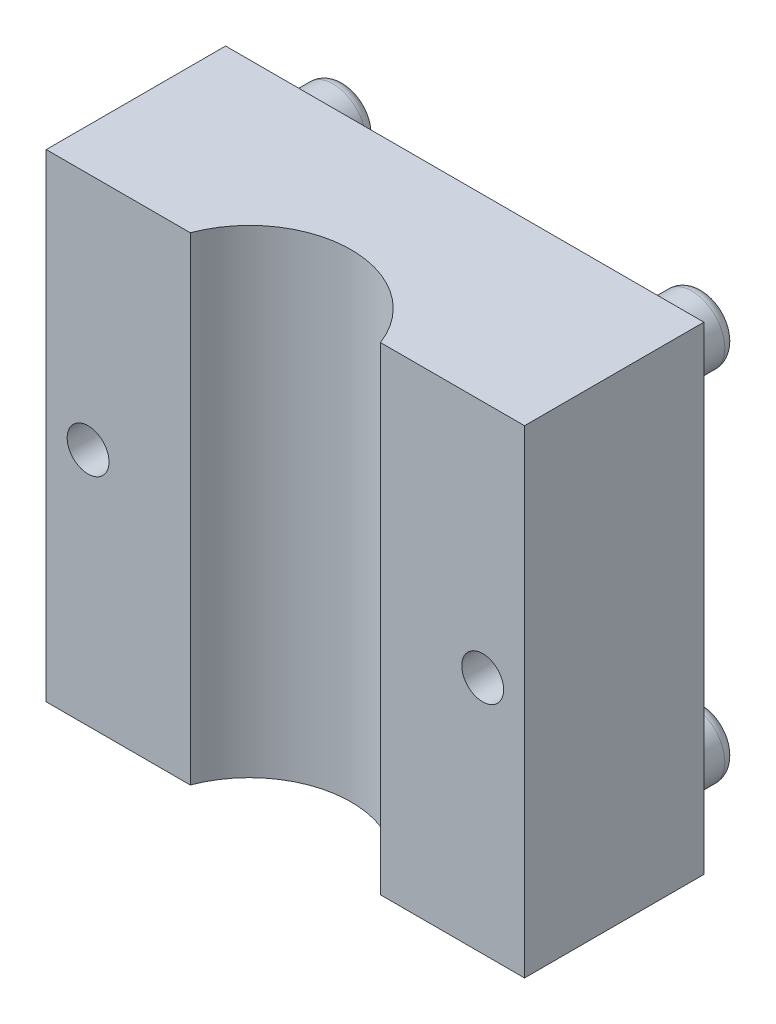
ISO-10303-21;
HEADER;
FILE_DESCRIPTION(('STEP AP214'),'2;1');
FILE_NAME('part.step','',(''),(''),'','','');
FILE_SCHEMA(('AUTOMOTIVE_DESIGN { 1 0 10303 214 1 1 1 1 }'));
ENDSEC;
DATA;
#1=APPLICATION_CONTEXT('core data for automotive mechanical design processes');
#2=APPLICATION_PROTOCOL_DEFINITION('international standard','automotive_design',2000,#1);
#3=PRODUCT_CONTEXT('',#1,'mechanical');
#4=PRODUCT('Part','Part','',(#3));
#5=PRODUCT_RELATED_PRODUCT_CATEGORY('part','',(#4));
#6=PRODUCT_DEFINITION_FORMATION('','',#4);
#7=PRODUCT_DEFINITION_CONTEXT('part definition',#1,'design');
#8=PRODUCT_DEFINITION('design','',#6,#7);
#9=PRODUCT_DEFINITION_SHAPE('','',#8);
#10=(LENGTH_UNIT() NAMED_UNIT(*) SI_UNIT(.MILLI.,.METRE.));
#11=(NAMED_UNIT(*) PLANE_ANGLE_UNIT() SI_UNIT($,.RADIAN.));
#12=(NAMED_UNIT(*) SI_UNIT($,.STERADIAN.) SOLID_ANGLE_UNIT());
#13=UNCERTAINTY_MEASURE_WITH_UNIT(LENGTH_MEASURE(1.E-05),#10,'distance_accuracy_value','');
#14=(GEOMETRIC_REPRESENTATION_CONTEXT(3) GLOBAL_UNCERTAINTY_ASSIGNED_CONTEXT((#13)) GLOBAL_UNIT_ASSIGNED_CONTEXT((#10,
#11,#12)) REPRESENTATION_CONTEXT('',''));
#15=CARTESIAN_POINT('',(0.,0.,0.));
#16=DIRECTION('',(0.,0.,1.));
#17=DIRECTION('',(1.,0.,0.));
#18=AXIS2_PLACEMENT_3D('',#15,#16,#17);
#19=CARTESIAN_POINT('',(0.,0.,15.));
#20=DIRECTION('',(0.,0.,1.));
#21=DIRECTION('',(1.,0.,0.));
#22=AXIS2_PLACEMENT_3D('',#19,#20,#21);
#23=PLANE('',#22);
#24=CARTESIAN_POINT('',(16.5,0.,15.));
#25=DIRECTION('',(0.,0.,-1.));
#26=DIRECTION('',(-1.,0.,0.));
#27=AXIS2_PLACEMENT_3D('',#24,#25,#26);
#28=CIRCLE('',#27,1.75);
#29=CARTESIAN_POINT('',(14.75,0.,15.));
#30=VERTEX_POINT('',#29);
#31=EDGE_CURVE('E184',#30,#30,#28,.T.);
#32=ORIENTED_EDGE('',*,*,#31,.T.);
#33=EDGE_LOOP('',(#32));
#34=FACE_BOUND('',#33,.T.);
#35=DIRECTION('',(0.,1.,0.));
#36=VECTOR('',#35,1.);
#37=CARTESIAN_POINT('',(7.95298686029343,-20.,15.));
#38=LINE('',#37,#36);
#39=CARTESIAN_POINT('',(7.95298686029343,-20.,15.));
#40=VERTEX_POINT('',#39);
#41=CARTESIAN_POINT('',(7.95298686029343,20.,15.));
#42=VERTEX_POINT('',#41);
#43=EDGE_CURVE('E11',#40,#42,#38,.T.);
#44=ORIENTED_EDGE('',*,*,#43,.F.);
#45=DIRECTION('',(1.,0.,0.));
#46=VECTOR('',#45,1.);
#47=CARTESIAN_POINT('',(-20.,-20.,15.));
#48=LINE('',#47,#46);
#49=CARTESIAN_POINT('',(20.,-20.,15.));
#50=VERTEX_POINT('',#49);
#51=EDGE_CURVE('E58',#40,#50,#48,.T.);
#52=ORIENTED_EDGE('',*,*,#51,.T.);
#53=DIRECTION('',(0.,1.,0.));
#54=VECTOR('',#53,1.);
#55=CARTESIAN_POINT('',(20.,20.,15.));
#56=LINE('',#55,#54);
#57=CARTESIAN_POINT('',(20.,20.,15.));
#58=VERTEX_POINT('',#57);
#59=EDGE_CURVE('E105',#50,#58,#56,.T.);
#60=ORIENTED_EDGE('',*,*,#59,.T.);
#61=DIRECTION('',(-1.,0.,0.));
#62=VECTOR('',#61,1.);
#63=CARTESIAN_POINT('',(-20.,20.,15.));
#64=LINE('',#63,#62);
#65=EDGE_CURVE('E87',#58,#42,#64,.T.);
#66=ORIENTED_EDGE('',*,*,#65,.T.);
#67=EDGE_LOOP('',(#44,#52,#60,#66));
#68=FACE_BOUND('',#67,.T.);
#69=ADVANCED_FACE('F33',(#34,#68),#23,.T.);
#70=CARTESIAN_POINT('',(0.,0.,0.));
#71=DIRECTION('',(0.,0.,1.));
#72=DIRECTION('',(1.,0.,0.));
#73=AXIS2_PLACEMENT_3D('',#70,#71,#72);
#74=PLANE('',#73);
#75=CARTESIAN_POINT('',(-16.5,0.,0.));
#76=DIRECTION('',(0.,0.,-1.));
#77=DIRECTION('',(-1.,0.,0.));
#78=AXIS2_PLACEMENT_3D('',#75,#76,#77);
#79=CIRCLE('',#78,3.);
#80=CARTESIAN_POINT('',(-19.5,0.,0.));
#81=VERTEX_POINT('',#80);
#82=EDGE_CURVE('E172',#81,#81,#79,.T.);
#83=ORIENTED_EDGE('',*,*,#82,.F.);
#84=EDGE_LOOP('',(#83));
#85=FACE_BOUND('',#84,.T.);
#86=CARTESIAN_POINT('',(16.5,0.,0.));
#87=DIRECTION('',(0.,0.,-1.));
#88=DIRECTION('',(-1.,0.,0.));
#89=AXIS2_PLACEMENT_3D('',#86,#87,#88);
#90=CIRCLE('',#89,3.);
#91=CARTESIAN_POINT('',(13.5,0.,0.));
#92=VERTEX_POINT('',#91);
#93=EDGE_CURVE('E188',#92,#92,#90,.T.);
#94=ORIENTED_EDGE('',*,*,#93,.F.);
#95=EDGE_LOOP('',(#94));
#96=FACE_BOUND('',#95,.T.);
#97=CARTESIAN_POINT('',(0.,0.,0.));
#98=DIRECTION('',(0.,0.,-1.));
#99=DIRECTION('',(-1.,0.,0.));
#100=AXIS2_PLACEMENT_3D('',#97,#98,#99);
#101=CIRCLE('',#100,12.5);
#102=CARTESIAN_POINT('',(-12.5,0.,0.));
#103=VERTEX_POINT('',#102);
#104=EDGE_CURVE('E194',#103,#103,#101,.T.);
#105=ORIENTED_EDGE('',*,*,#104,.F.);
#106=EDGE_LOOP('',(#105));
#107=FACE_BOUND('',#106,.T.);
#108=CARTESIAN_POINT('',(15.,-15.,0.));
#109=DIRECTION('',(0.,0.,1.));
#110=DIRECTION('',(1.,0.,0.));
#111=AXIS2_PLACEMENT_3D('',#108,#109,#110);
#112=CIRCLE('',#111,2.75);
#113=CARTESIAN_POINT('',(17.75,-15.,0.));
#114=VERTEX_POINT('',#113);
#115=EDGE_CURVE('E140',#114,#114,#112,.F.);
#116=ORIENTED_EDGE('',*,*,#115,.F.);
#117=EDGE_LOOP('',(#116));
#118=FACE_BOUND('',#117,.T.);
#119=CARTESIAN_POINT('',(15.,15.,0.));
#120=DIRECTION('',(0.,0.,1.));
#121=DIRECTION('',(1.,0.,0.));
#122=AXIS2_PLACEMENT_3D('',#119,#120,#121);
#123=CIRCLE('',#122,2.75);
#124=CARTESIAN_POINT('',(17.75,15.,0.));
#125=VERTEX_POINT('',#124);
#126=EDGE_CURVE('E134',#125,#125,#123,.F.);
#127=ORIENTED_EDGE('',*,*,#126,.F.);
#128=EDGE_LOOP('',(#127));
#129=FACE_BOUND('',#128,.T.);
#130=DIRECTION('',(0.,1.,0.));
#131=VECTOR('',#130,1.);
#132=CARTESIAN_POINT('',(20.,20.,0.));
#133=LINE('',#132,#131);
#134=CARTESIAN_POINT('',(20.,-20.,0.));
#135=VERTEX_POINT('',#134);
#136=CARTESIAN_POINT('',(20.,20.,0.));
#137=VERTEX_POINT('',#136);
#138=EDGE_CURVE('E117',#135,#137,#133,.T.);
#139=ORIENTED_EDGE('',*,*,#138,.F.);
#140=DIRECTION('',(1.,0.,0.));
#141=VECTOR('',#140,1.);
#142=CARTESIAN_POINT('',(-20.,-20.,0.));
#143=LINE('',#142,#141);
#144=CARTESIAN_POINT('',(-20.,-20.,0.));
#145=VERTEX_POINT('',#144);
#146=EDGE_CURVE('E80',#145,#135,#143,.T.);
#147=ORIENTED_EDGE('',*,*,#146,.F.);
#148=DIRECTION('',(0.,-1.,0.));
#149=VECTOR('',#148,1.);
#150=CARTESIAN_POINT('',(-20.,20.,0.));
#151=LINE('',#150,#149);
#152=CARTESIAN_POINT('',(-20.,20.,0.));
#153=VERTEX_POINT('',#152);
#154=EDGE_CURVE('E123',#153,#145,#151,.T.);
#155=ORIENTED_EDGE('',*,*,#154,.F.);
#156=DIRECTION('',(-1.,0.,0.));
#157=VECTOR('',#156,1.);
#158=CARTESIAN_POINT('',(-20.,20.,0.));
#159=LINE('',#158,#157);
#160=EDGE_CURVE('E120',#137,#153,#159,.T.);
#161=ORIENTED_EDGE('',*,*,#160,.F.);
#162=EDGE_LOOP('',(#139,#147,#155,#161));
#163=FACE_BOUND('',#162,.T.);
#164=CARTESIAN_POINT('',(-15.,15.,0.));
#165=DIRECTION('',(0.,0.,1.));
#166=DIRECTION('',(1.,0.,0.));
#167=AXIS2_PLACEMENT_3D('',#164,#165,#166);
#168=CIRCLE('',#167,2.75);
#169=CARTESIAN_POINT('',(-12.25,15.,0.));
#170=VERTEX_POINT('',#169);
#171=EDGE_CURVE('E137',#170,#170,#168,.F.);
#172=ORIENTED_EDGE('',*,*,#171,.F.);
#173=EDGE_LOOP('',(#172));
#174=FACE_BOUND('',#173,.T.);
#175=CARTESIAN_POINT('',(-15.,-15.,0.));
#176=DIRECTION('',(0.,0.,1.));
#177=DIRECTION('',(1.,0.,0.));
#178=AXIS2_PLACEMENT_3D('',#175,#176,#177);
#179=CIRCLE('',#178,2.74999999999999);
#180=CARTESIAN_POINT('',(-12.25,-15.,0.));
#181=VERTEX_POINT('',#180);
#182=EDGE_CURVE('E143',#181,#181,#179,.F.);
#183=ORIENTED_EDGE('',*,*,#182,.F.);
#184=EDGE_LOOP('',(#183));
#185=FACE_BOUND('',#184,.T.);
#186=ADVANCED_FACE('F202',(#85,#96,#107,#118,#129,#163,#174,#185),#74,.F.);
#187=CARTESIAN_POINT('',(20.,20.,15.));
#188=DIRECTION('',(-1.,0.,0.));
#189=DIRECTION('',(0.,-1.,0.));
#190=AXIS2_PLACEMENT_3D('',#187,#188,#189);
#191=PLANE('',#190);
#192=ORIENTED_EDGE('',*,*,#138,.T.);
#193=DIRECTION('',(0.,0.,-1.));
#194=VECTOR('',#193,1.);
#195=CARTESIAN_POINT('',(20.,20.,15.));
#196=LINE('',#195,#194);
#197=EDGE_CURVE('E132',#58,#137,#196,.T.);
#198=ORIENTED_EDGE('',*,*,#197,.F.);
#199=ORIENTED_EDGE('',*,*,#59,.F.);
#200=DIRECTION('',(0.,0.,-1.));
#201=VECTOR('',#200,1.);
#202=CARTESIAN_POINT('',(20.,-20.,15.));
#203=LINE('',#202,#201);
#204=EDGE_CURVE('E116',#50,#135,#203,.T.);
#205=ORIENTED_EDGE('',*,*,#204,.T.);
#206=EDGE_LOOP('',(#192,#198,#199,#205));
#207=FACE_BOUND('',#206,.T.);
#208=ADVANCED_FACE('F205',(#207),#191,.F.);
#209=CARTESIAN_POINT('',(-20.,20.,15.));
#210=DIRECTION('',(0.,-1.,0.));
#211=DIRECTION('',(0.,0.,-1.));
#212=AXIS2_PLACEMENT_3D('',#209,#210,#211);
#213=PLANE('',#212);
#214=CARTESIAN_POINT('',(-7.95298686029344,20.,15.));
#215=VERTEX_POINT('',#214);
#216=CARTESIAN_POINT('',(-20.,20.,15.));
#217=VERTEX_POINT('',#216);
#218=EDGE_CURVE('E101',#215,#217,#64,.T.);
#219=ORIENTED_EDGE('',*,*,#218,.F.);
#220=CARTESIAN_POINT('',(0.,20.,18.));
#221=DIRECTION('',(0.,1.,0.));
#222=DIRECTION('',(0.,0.,1.));
#223=AXIS2_PLACEMENT_3D('',#220,#221,#222);
#224=CIRCLE('',#223,8.5);
#225=EDGE_CURVE('E49',#42,#215,#224,.T.);
#226=ORIENTED_EDGE('',*,*,#225,.F.);
#227=ORIENTED_EDGE('',*,*,#65,.F.);
#228=ORIENTED_EDGE('',*,*,#197,.T.);
#229=ORIENTED_EDGE('',*,*,#160,.T.);
#230=DIRECTION('',(0.,0.,-1.));
#231=VECTOR('',#230,1.);
#232=CARTESIAN_POINT('',(-20.,20.,15.));
#233=LINE('',#232,#231);
#234=EDGE_CURVE('E129',#217,#153,#233,.T.);
#235=ORIENTED_EDGE('',*,*,#234,.F.);
#236=EDGE_LOOP('',(#219,#226,#227,#228,#229,#235));
#237=FACE_BOUND('',#236,.T.);
#238=ADVANCED_FACE('F99',(#237),#213,.F.);
#239=CARTESIAN_POINT('',(-20.,20.,15.));
#240=DIRECTION('',(1.,0.,0.));
#241=DIRECTION('',(0.,1.,0.));
#242=AXIS2_PLACEMENT_3D('',#239,#240,#241);
#243=PLANE('',#242);
#244=ORIENTED_EDGE('',*,*,#154,.T.);
#245=DIRECTION('',(0.,0.,-1.));
#246=VECTOR('',#245,1.);
#247=CARTESIAN_POINT('',(-20.,-20.,15.));
#248=LINE('',#247,#246);
#249=CARTESIAN_POINT('',(-20.,-20.,15.));
#250=VERTEX_POINT('',#249);
#251=EDGE_CURVE('E127',#250,#145,#248,.T.);
#252=ORIENTED_EDGE('',*,*,#251,.F.);
#253=DIRECTION('',(0.,-1.,0.));
#254=VECTOR('',#253,1.);
#255=CARTESIAN_POINT('',(-20.,20.,15.));
#256=LINE('',#255,#254);
#257=EDGE_CURVE('E107',#217,#250,#256,.T.);
#258=ORIENTED_EDGE('',*,*,#257,.F.);
#259=ORIENTED_EDGE('',*,*,#234,.T.);
#260=EDGE_LOOP('',(#244,#252,#258,#259));
#261=FACE_BOUND('',#260,.T.);
#262=ADVANCED_FACE('F251',(#261),#243,.F.);
#263=CARTESIAN_POINT('',(-20.,-20.,15.));
#264=DIRECTION('',(0.,1.,0.));
#265=DIRECTION('',(0.,0.,1.));
#266=AXIS2_PLACEMENT_3D('',#263,#264,#265);
#267=PLANE('',#266);
#268=ORIENTED_EDGE('',*,*,#51,.F.);
#269=CARTESIAN_POINT('',(0.,-20.,18.));
#270=DIRECTION('',(0.,1.,0.));
#271=DIRECTION('',(0.,0.,1.));
#272=AXIS2_PLACEMENT_3D('',#269,#270,#271);
#273=CIRCLE('',#272,8.5);
#274=CARTESIAN_POINT('',(-7.95298686029344,-20.,15.));
#275=VERTEX_POINT('',#274);
#276=EDGE_CURVE('E97',#40,#275,#273,.T.);
#277=ORIENTED_EDGE('',*,*,#276,.T.);
#278=EDGE_CURVE('E113',#250,#275,#48,.T.);
#279=ORIENTED_EDGE('',*,*,#278,.F.);
#280=ORIENTED_EDGE('',*,*,#251,.T.);
#281=ORIENTED_EDGE('',*,*,#146,.T.);
#282=ORIENTED_EDGE('',*,*,#204,.F.);
#283=EDGE_LOOP('',(#268,#277,#279,#280,#281,#282));
#284=FACE_BOUND('',#283,.T.);
#285=ADVANCED_FACE('F244',(#284),#267,.F.);
#286=CARTESIAN_POINT('',(-16.5,0.,15.));
#287=DIRECTION('',(0.,0.,-1.));
#288=DIRECTION('',(-1.,0.,0.));
#289=AXIS2_PLACEMENT_3D('',#286,#287,#288);
#290=CIRCLE('',#289,1.75);
#291=CARTESIAN_POINT('',(-18.25,0.,15.));
#292=VERTEX_POINT('',#291);
#293=EDGE_CURVE('E173',#292,#292,#290,.T.);
#294=ORIENTED_EDGE('',*,*,#293,.T.);
#295=EDGE_LOOP('',(#294));
#296=FACE_BOUND('',#295,.T.);
#297=DIRECTION('',(0.,1.,0.));
#298=VECTOR('',#297,1.);
#299=CARTESIAN_POINT('',(-7.95298686029344,-20.,15.));
#300=LINE('',#299,#298);
#301=EDGE_CURVE('E42',#215,#275,#300,.F.);
#302=ORIENTED_EDGE('',*,*,#301,.F.);
#303=ORIENTED_EDGE('',*,*,#218,.T.);
#304=ORIENTED_EDGE('',*,*,#257,.T.);
#305=ORIENTED_EDGE('',*,*,#278,.T.);
#306=EDGE_LOOP('',(#302,#303,#304,#305));
#307=FACE_BOUND('',#306,.T.);
#308=ADVANCED_FACE('F237',(#296,#307),#23,.T.);
#309=CARTESIAN_POINT('',(15.,15.,-5.));
#310=DIRECTION('',(0.,0.,1.));
#311=DIRECTION('',(1.,0.,0.));
#312=AXIS2_PLACEMENT_3D('',#309,#310,#311);
#313=CYLINDRICAL_SURFACE('',#312,2.75);
#314=CARTESIAN_POINT('',(15.,15.,-4.));
#315=DIRECTION('',(0.,0.,-1.));
#316=DIRECTION('',(-1.,0.,0.));
#317=AXIS2_PLACEMENT_3D('',#314,#315,#316);
#318=CIRCLE('',#317,2.75);
#319=CARTESIAN_POINT('',(12.25,15.,-4.));
#320=VERTEX_POINT('',#319);
#321=EDGE_CURVE('E167',#320,#320,#318,.F.);
#322=ORIENTED_EDGE('',*,*,#321,.T.);
#323=EDGE_LOOP('',(#322));
#324=FACE_BOUND('',#323,.T.);
#325=ORIENTED_EDGE('',*,*,#126,.T.);
#326=EDGE_LOOP('',(#325));
#327=FACE_BOUND('',#326,.T.);
#328=ADVANCED_FACE('F243',(#324,#327),#313,.T.);
#329=CARTESIAN_POINT('',(15.,15.,-5.));
#330=DIRECTION('',(0.,0.,-1.));
#331=DIRECTION('',(-1.,0.,0.));
#332=AXIS2_PLACEMENT_3D('',#329,#330,#331);
#333=PLANE('',#332);
#334=CARTESIAN_POINT('',(15.,15.,-5.));
#335=DIRECTION('',(0.,0.,-1.));
#336=DIRECTION('',(-1.,0.,0.));
#337=AXIS2_PLACEMENT_3D('',#334,#335,#336);
#338=CIRCLE('',#337,1.75);
#339=CARTESIAN_POINT('',(13.25,15.,-5.));
#340=VERTEX_POINT('',#339);
#341=EDGE_CURVE('E164',#340,#340,#338,.T.);
#342=ORIENTED_EDGE('',*,*,#341,.T.);
#343=EDGE_LOOP('',(#342));
#344=FACE_BOUND('',#343,.T.);
#345=ADVANCED_FACE('F249',(#344),#333,.T.);
#346=CARTESIAN_POINT('',(-15.,15.,-5.));
#347=DIRECTION('',(0.,0.,1.));
#348=DIRECTION('',(1.,0.,0.));
#349=AXIS2_PLACEMENT_3D('',#346,#347,#348);
#350=CYLINDRICAL_SURFACE('',#349,2.75);
#351=CARTESIAN_POINT('',(-15.,15.,-4.));
#352=DIRECTION('',(0.,0.,-1.));
#353=DIRECTION('',(-1.,0.,0.));
#354=AXIS2_PLACEMENT_3D('',#351,#352,#353);
#355=CIRCLE('',#354,2.75);
#356=CARTESIAN_POINT('',(-17.75,15.,-4.));
#357=VERTEX_POINT('',#356);
#358=EDGE_CURVE('E161',#357,#357,#355,.F.);
#359=ORIENTED_EDGE('',*,*,#358,.T.);
#360=EDGE_LOOP('',(#359));
#361=FACE_BOUND('',#360,.T.);
#362=ORIENTED_EDGE('',*,*,#171,.T.);
#363=EDGE_LOOP('',(#362));
#364=FACE_BOUND('',#363,.T.);
#365=ADVANCED_FACE('F288',(#361,#364),#350,.T.);
#366=CARTESIAN_POINT('',(-15.,15.,-5.));
#367=DIRECTION('',(0.,0.,-1.));
#368=DIRECTION('',(-1.,0.,0.));
#369=AXIS2_PLACEMENT_3D('',#366,#367,#368);
#370=PLANE('',#369);
#371=CARTESIAN_POINT('',(-15.,15.,-5.));
#372=DIRECTION('',(0.,0.,-1.));
#373=DIRECTION('',(-1.,0.,0.));
#374=AXIS2_PLACEMENT_3D('',#371,#372,#373);
#375=CIRCLE('',#374,1.75);
#376=CARTESIAN_POINT('',(-16.75,15.,-5.));
#377=VERTEX_POINT('',#376);
#378=EDGE_CURVE('E158',#377,#377,#375,.T.);
#379=ORIENTED_EDGE('',*,*,#378,.T.);
#380=EDGE_LOOP('',(#379));
#381=FACE_BOUND('',#380,.T.);
#382=ADVANCED_FACE('F286',(#381),#370,.T.);
#383=CARTESIAN_POINT('',(15.,-15.,-5.));
#384=DIRECTION('',(0.,0.,1.));
#385=DIRECTION('',(1.,0.,0.));
#386=AXIS2_PLACEMENT_3D('',#383,#384,#385);
#387=CYLINDRICAL_SURFACE('',#386,2.75);
#388=CARTESIAN_POINT('',(15.,-15.,-4.));
#389=DIRECTION('',(0.,0.,-1.));
#390=DIRECTION('',(-1.,0.,0.));
#391=AXIS2_PLACEMENT_3D('',#388,#389,#390);
#392=CIRCLE('',#391,2.75);
#393=CARTESIAN_POINT('',(12.25,-15.,-4.));
#394=VERTEX_POINT('',#393);
#395=EDGE_CURVE('E149',#394,#394,#392,.F.);
#396=ORIENTED_EDGE('',*,*,#395,.T.);
#397=EDGE_LOOP('',(#396));
#398=FACE_BOUND('',#397,.T.);
#399=ORIENTED_EDGE('',*,*,#115,.T.);
#400=EDGE_LOOP('',(#399));
#401=FACE_BOUND('',#400,.T.);
#402=ADVANCED_FACE('F231',(#398,#401),#387,.T.);
#403=CARTESIAN_POINT('',(15.,-15.,-5.));
#404=DIRECTION('',(0.,0.,-1.));
#405=DIRECTION('',(-1.,0.,0.));
#406=AXIS2_PLACEMENT_3D('',#403,#404,#405);
#407=PLANE('',#406);
#408=CARTESIAN_POINT('',(15.,-15.,-5.));
#409=DIRECTION('',(0.,0.,-1.));
#410=DIRECTION('',(-1.,0.,0.));
#411=AXIS2_PLACEMENT_3D('',#408,#409,#410);
#412=CIRCLE('',#411,1.75);
#413=CARTESIAN_POINT('',(13.25,-15.,-5.));
#414=VERTEX_POINT('',#413);
#415=EDGE_CURVE('E146',#414,#414,#412,.T.);
#416=ORIENTED_EDGE('',*,*,#415,.T.);
#417=EDGE_LOOP('',(#416));
#418=FACE_BOUND('',#417,.T.);
#419=ADVANCED_FACE('F221',(#418),#407,.T.);
#420=CARTESIAN_POINT('',(-15.,-15.,-5.));
#421=DIRECTION('',(0.,0.,1.));
#422=DIRECTION('',(1.,0.,0.));
#423=AXIS2_PLACEMENT_3D('',#420,#421,#422);
#424=CYLINDRICAL_SURFACE('',#423,2.74999999999999);
#425=CARTESIAN_POINT('',(-15.,-15.,-4.));
#426=DIRECTION('',(0.,0.,-1.));
#427=DIRECTION('',(-1.,0.,0.));
#428=AXIS2_PLACEMENT_3D('',#425,#426,#427);
#429=CIRCLE('',#428,2.74999999999999);
#430=CARTESIAN_POINT('',(-17.75,-15.,-4.));
#431=VERTEX_POINT('',#430);
#432=EDGE_CURVE('E155',#431,#431,#429,.F.);
#433=ORIENTED_EDGE('',*,*,#432,.T.);
#434=EDGE_LOOP('',(#433));
#435=FACE_BOUND('',#434,.T.);
#436=ORIENTED_EDGE('',*,*,#182,.T.);
#437=EDGE_LOOP('',(#436));
#438=FACE_BOUND('',#437,.T.);
#439=ADVANCED_FACE('F218',(#435,#438),#424,.T.);
#440=CARTESIAN_POINT('',(-15.,-15.,-5.));
#441=DIRECTION('',(0.,0.,-1.));
#442=DIRECTION('',(-1.,0.,0.));
#443=AXIS2_PLACEMENT_3D('',#440,#441,#442);
#444=PLANE('',#443);
#445=CARTESIAN_POINT('',(-15.,-15.,-5.));
#446=DIRECTION('',(0.,0.,-1.));
#447=DIRECTION('',(-1.,0.,0.));
#448=AXIS2_PLACEMENT_3D('',#445,#446,#447);
#449=CIRCLE('',#448,1.74999999999999);
#450=CARTESIAN_POINT('',(-16.75,-15.,-5.));
#451=VERTEX_POINT('',#450);
#452=EDGE_CURVE('E152',#451,#451,#449,.T.);
#453=ORIENTED_EDGE('',*,*,#452,.T.);
#454=EDGE_LOOP('',(#453));
#455=FACE_BOUND('',#454,.T.);
#456=ADVANCED_FACE('F220',(#455),#444,.T.);
#457=CARTESIAN_POINT('',(15.,-15.,-4.));
#458=DIRECTION('',(0.,0.,-1.));
#459=DIRECTION('',(-1.,0.,0.));
#460=AXIS2_PLACEMENT_3D('',#457,#458,#459);
#461=TOROIDAL_SURFACE('',#460,1.75,1.);
#462=ORIENTED_EDGE('',*,*,#395,.F.);
#463=EDGE_LOOP('',(#462));
#464=FACE_BOUND('',#463,.T.);
#465=ORIENTED_EDGE('',*,*,#415,.F.);
#466=EDGE_LOOP('',(#465));
#467=FACE_BOUND('',#466,.T.);
#468=ADVANCED_FACE('F228',(#464,#467),#461,.T.);
#469=CARTESIAN_POINT('',(-15.,-15.,-4.));
#470=DIRECTION('',(0.,0.,-1.));
#471=DIRECTION('',(-1.,0.,0.));
#472=AXIS2_PLACEMENT_3D('',#469,#470,#471);
#473=TOROIDAL_SURFACE('',#472,1.74999999999999,1.);
#474=ORIENTED_EDGE('',*,*,#432,.F.);
#475=EDGE_LOOP('',(#474));
#476=FACE_BOUND('',#475,.T.);
#477=ORIENTED_EDGE('',*,*,#452,.F.);
#478=EDGE_LOOP('',(#477));
#479=FACE_BOUND('',#478,.T.);
#480=ADVANCED_FACE('F271',(#476,#479),#473,.T.);
#481=CARTESIAN_POINT('',(-15.,15.,-4.));
#482=DIRECTION('',(0.,0.,-1.));
#483=DIRECTION('',(-1.,0.,0.));
#484=AXIS2_PLACEMENT_3D('',#481,#482,#483);
#485=TOROIDAL_SURFACE('',#484,1.75,1.);
#486=ORIENTED_EDGE('',*,*,#358,.F.);
#487=EDGE_LOOP('',(#486));
#488=FACE_BOUND('',#487,.T.);
#489=ORIENTED_EDGE('',*,*,#378,.F.);
#490=EDGE_LOOP('',(#489));
#491=FACE_BOUND('',#490,.T.);
#492=ADVANCED_FACE('F274',(#488,#491),#485,.T.);
#493=CARTESIAN_POINT('',(15.,15.,-4.));
#494=DIRECTION('',(0.,0.,-1.));
#495=DIRECTION('',(-1.,0.,0.));
#496=AXIS2_PLACEMENT_3D('',#493,#494,#495);
#497=TOROIDAL_SURFACE('',#496,1.75,1.);
#498=ORIENTED_EDGE('',*,*,#321,.F.);
#499=EDGE_LOOP('',(#498));
#500=FACE_BOUND('',#499,.T.);
#501=ORIENTED_EDGE('',*,*,#341,.F.);
#502=EDGE_LOOP('',(#501));
#503=FACE_BOUND('',#502,.T.);
#504=ADVANCED_FACE('F35',(#500,#503),#497,.T.);
#505=CARTESIAN_POINT('',(0.,0.,3.5));
#506=DIRECTION('',(0.,0.,-1.));
#507=DIRECTION('',(-1.,0.,0.));
#508=AXIS2_PLACEMENT_3D('',#505,#506,#507);
#509=CYLINDRICAL_SURFACE('',#508,12.5);
#510=CARTESIAN_POINT('',(0.,0.,3.5));
#511=DIRECTION('',(0.,0.,-1.));
#512=DIRECTION('',(-1.,0.,0.));
#513=AXIS2_PLACEMENT_3D('',#510,#511,#512);
#514=CIRCLE('',#513,12.5);
#515=CARTESIAN_POINT('',(-12.5,0.,3.5));
#516=VERTEX_POINT('',#515);
#517=EDGE_CURVE('E121',#516,#516,#514,.T.);
#518=ORIENTED_EDGE('',*,*,#517,.F.);
#519=EDGE_LOOP('',(#518));
#520=FACE_BOUND('',#519,.T.);
#521=ORIENTED_EDGE('',*,*,#104,.T.);
#522=EDGE_LOOP('',(#521));
#523=FACE_BOUND('',#522,.T.);
#524=ADVANCED_FACE('F200',(#520,#523),#509,.F.);
#525=CARTESIAN_POINT('',(0.,0.,3.5));
#526=DIRECTION('',(0.,0.,-1.));
#527=DIRECTION('',(-1.,0.,0.));
#528=AXIS2_PLACEMENT_3D('',#525,#526,#527);
#529=PLANE('',#528);
#530=ORIENTED_EDGE('',*,*,#517,.T.);
#531=EDGE_LOOP('',(#530));
#532=FACE_BOUND('',#531,.T.);
#533=ADVANCED_FACE('F368',(#532),#529,.T.);
#534=CARTESIAN_POINT('',(0.,-20.,18.));
#535=DIRECTION('',(0.,1.,0.));
#536=DIRECTION('',(0.,0.,1.));
#537=AXIS2_PLACEMENT_3D('',#534,#535,#536);
#538=CYLINDRICAL_SURFACE('',#537,8.5);
#539=ORIENTED_EDGE('',*,*,#43,.T.);
#540=ORIENTED_EDGE('',*,*,#225,.T.);
#541=ORIENTED_EDGE('',*,*,#301,.T.);
#542=ORIENTED_EDGE('',*,*,#276,.F.);
#543=EDGE_LOOP('',(#539,#540,#541,#542));
#544=FACE_BOUND('',#543,.T.);
#545=ADVANCED_FACE('F95',(#544),#538,.F.);
#546=CARTESIAN_POINT('',(16.5,0.,2.));
#547=DIRECTION('',(0.,0.,-1.));
#548=DIRECTION('',(-1.,0.,0.));
#549=AXIS2_PLACEMENT_3D('',#546,#547,#548);
#550=CYLINDRICAL_SURFACE('',#549,3.);
#551=CARTESIAN_POINT('',(16.5,0.,2.));
#552=DIRECTION('',(0.,0.,-1.));
#553=DIRECTION('',(-1.,0.,0.));
#554=AXIS2_PLACEMENT_3D('',#551,#552,#553);
#555=CIRCLE('',#554,3.);
#556=CARTESIAN_POINT('',(13.5,0.,2.));
#557=VERTEX_POINT('',#556);
#558=EDGE_CURVE('E102',#557,#557,#555,.T.);
#559=ORIENTED_EDGE('',*,*,#558,.F.);
#560=EDGE_LOOP('',(#559));
#561=FACE_BOUND('',#560,.T.);
#562=ORIENTED_EDGE('',*,*,#93,.T.);
#563=EDGE_LOOP('',(#562));
#564=FACE_BOUND('',#563,.T.);
#565=ADVANCED_FACE('F403',(#561,#564),#550,.F.);
#566=CARTESIAN_POINT('',(16.5,0.,2.));
#567=DIRECTION('',(0.,0.,-1.));
#568=DIRECTION('',(-1.,0.,0.));
#569=AXIS2_PLACEMENT_3D('',#566,#567,#568);
#570=PLANE('',#569);
#571=CARTESIAN_POINT('',(16.5,0.,2.));
#572=DIRECTION('',(0.,0.,-1.));
#573=DIRECTION('',(-1.,0.,0.));
#574=AXIS2_PLACEMENT_3D('',#571,#572,#573);
#575=CIRCLE('',#574,1.75);
#576=CARTESIAN_POINT('',(14.75,0.,2.));
#577=VERTEX_POINT('',#576);
#578=EDGE_CURVE('E37',#577,#577,#575,.T.);
#579=ORIENTED_EDGE('',*,*,#578,.F.);
#580=EDGE_LOOP('',(#579));
#581=FACE_BOUND('',#580,.T.);
#582=ORIENTED_EDGE('',*,*,#558,.T.);
#583=EDGE_LOOP('',(#582));
#584=FACE_BOUND('',#583,.T.);
#585=ADVANCED_FACE('F419',(#581,#584),#570,.T.);
#586=CARTESIAN_POINT('',(-16.5,0.,2.));
#587=DIRECTION('',(0.,0.,-1.));
#588=DIRECTION('',(-1.,0.,0.));
#589=AXIS2_PLACEMENT_3D('',#586,#587,#588);
#590=CYLINDRICAL_SURFACE('',#589,3.);
#591=CARTESIAN_POINT('',(-16.5,0.,2.));
#592=DIRECTION('',(0.,0.,-1.));
#593=DIRECTION('',(-1.,0.,0.));
#594=AXIS2_PLACEMENT_3D('',#591,#592,#593);
#595=CIRCLE('',#594,3.);
#596=CARTESIAN_POINT('',(-19.5,0.,2.));
#597=VERTEX_POINT('',#596);
#598=EDGE_CURVE('E177',#597,#597,#595,.T.);
#599=ORIENTED_EDGE('',*,*,#598,.F.);
#600=EDGE_LOOP('',(#599));
#601=FACE_BOUND('',#600,.T.);
#602=ORIENTED_EDGE('',*,*,#82,.T.);
#603=EDGE_LOOP('',(#602));
#604=FACE_BOUND('',#603,.T.);
#605=ADVANCED_FACE('F427',(#601,#604),#590,.F.);
#606=CARTESIAN_POINT('',(-16.5,0.,2.));
#607=DIRECTION('',(0.,0.,-1.));
#608=DIRECTION('',(-1.,0.,0.));
#609=AXIS2_PLACEMENT_3D('',#606,#607,#608);
#610=PLANE('',#609);
#611=CARTESIAN_POINT('',(-16.5,0.,2.));
#612=DIRECTION('',(0.,0.,-1.));
#613=DIRECTION('',(-1.,0.,0.));
#614=AXIS2_PLACEMENT_3D('',#611,#612,#613);
#615=CIRCLE('',#614,1.75);
#616=CARTESIAN_POINT('',(-18.25,0.,2.));
#617=VERTEX_POINT('',#616);
#618=EDGE_CURVE('E170',#617,#617,#615,.T.);
#619=ORIENTED_EDGE('',*,*,#618,.F.);
#620=EDGE_LOOP('',(#619));
#621=FACE_BOUND('',#620,.T.);
#622=ORIENTED_EDGE('',*,*,#598,.T.);
#623=EDGE_LOOP('',(#622));
#624=FACE_BOUND('',#623,.T.);
#625=ADVANCED_FACE('F431',(#621,#624),#610,.T.);
#626=CARTESIAN_POINT('',(-16.5,0.,15.));
#627=DIRECTION('',(0.,0.,-1.));
#628=DIRECTION('',(-1.,0.,0.));
#629=AXIS2_PLACEMENT_3D('',#626,#627,#628);
#630=CYLINDRICAL_SURFACE('',#629,1.75);
#631=ORIENTED_EDGE('',*,*,#618,.T.);
#632=EDGE_LOOP('',(#631));
#633=FACE_BOUND('',#632,.T.);
#634=ORIENTED_EDGE('',*,*,#293,.F.);
#635=EDGE_LOOP('',(#634));
#636=FACE_BOUND('',#635,.T.);
#637=ADVANCED_FACE('F455',(#633,#636),#630,.F.);
#638=CARTESIAN_POINT('',(16.5,0.,15.));
#639=DIRECTION('',(0.,0.,-1.));
#640=DIRECTION('',(-1.,0.,0.));
#641=AXIS2_PLACEMENT_3D('',#638,#639,#640);
#642=CYLINDRICAL_SURFACE('',#641,1.75);
#643=ORIENTED_EDGE('',*,*,#578,.T.);
#644=EDGE_LOOP('',(#643));
#645=FACE_BOUND('',#644,.T.);
#646=ORIENTED_EDGE('',*,*,#31,.F.);
#647=EDGE_LOOP('',(#646));
#648=FACE_BOUND('',#647,.T.);
#649=ADVANCED_FACE('F465',(#645,#648),#642,.F.);
#650=CLOSED_SHELL('',(#69,#186,#208,#238,#262,#285,#308,#328,#345,#365,#382,#402,#419,#439,#456,
#468,#480,#492,#504,#524,#533,#545,#565,#585,#605,#625,#637,#649));
#651=MANIFOLD_SOLID_BREP('B2',#650);
#652=ADVANCED_BREP_SHAPE_REPRESENTATION('',(#18,#651),#14);
#653=SHAPE_DEFINITION_REPRESENTATION(#9,#652);
ENDSEC;
END-ISO-10303-21;
